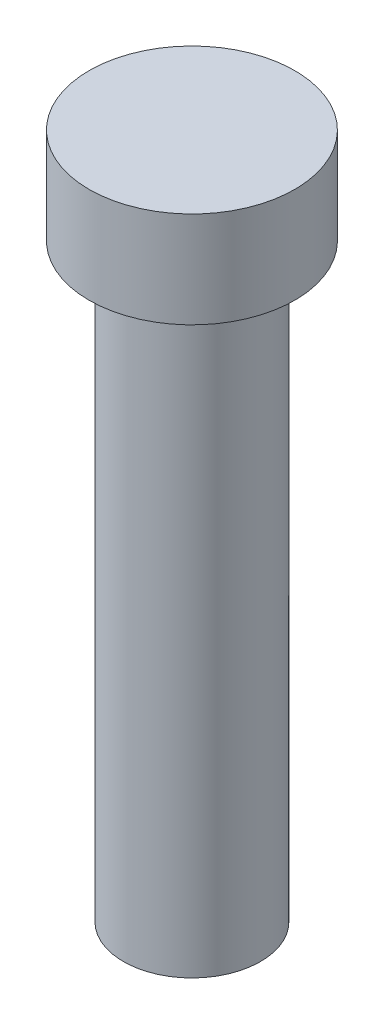
ISO-10303-21;
HEADER;
FILE_DESCRIPTION(('STEP AP214'),'2;1');
FILE_NAME('part.step','',(''),(''),'','','');
FILE_SCHEMA(('AUTOMOTIVE_DESIGN { 1 0 10303 214 1 1 1 1 }'));
ENDSEC;
DATA;
#1=APPLICATION_CONTEXT('core data for automotive mechanical design processes');
#2=APPLICATION_PROTOCOL_DEFINITION('international standard','automotive_design',2000,#1);
#3=PRODUCT_CONTEXT('',#1,'mechanical');
#4=PRODUCT('Part','Part','',(#3));
#5=PRODUCT_RELATED_PRODUCT_CATEGORY('part','',(#4));
#6=PRODUCT_DEFINITION_FORMATION('','',#4);
#7=PRODUCT_DEFINITION_CONTEXT('part definition',#1,'design');
#8=PRODUCT_DEFINITION('design','',#6,#7);
#9=PRODUCT_DEFINITION_SHAPE('','',#8);
#10=(LENGTH_UNIT() NAMED_UNIT(*) SI_UNIT(.MILLI.,.METRE.));
#11=(NAMED_UNIT(*) PLANE_ANGLE_UNIT() SI_UNIT($,.RADIAN.));
#12=(NAMED_UNIT(*) SI_UNIT($,.STERADIAN.) SOLID_ANGLE_UNIT());
#13=UNCERTAINTY_MEASURE_WITH_UNIT(LENGTH_MEASURE(1.E-05),#10,'distance_accuracy_value','');
#14=(GEOMETRIC_REPRESENTATION_CONTEXT(3) GLOBAL_UNCERTAINTY_ASSIGNED_CONTEXT((#13)) GLOBAL_UNIT_ASSIGNED_CONTEXT((#10,
#11,#12)) REPRESENTATION_CONTEXT('',''));
#15=CARTESIAN_POINT('',(0.,0.,0.));
#16=DIRECTION('',(0.,0.,1.));
#17=DIRECTION('',(1.,0.,0.));
#18=AXIS2_PLACEMENT_3D('',#15,#16,#17);
#19=CARTESIAN_POINT('',(0.,7.,0.));
#20=DIRECTION('',(0.,-1.,0.));
#21=DIRECTION('',(0.,0.,-1.));
#22=AXIS2_PLACEMENT_3D('',#19,#20,#21);
#23=CYLINDRICAL_SURFACE('',#22,7.5);
#24=CARTESIAN_POINT('',(0.,7.,0.));
#25=DIRECTION('',(0.,1.,0.));
#26=DIRECTION('',(0.,0.,1.));
#27=AXIS2_PLACEMENT_3D('',#24,#25,#26);
#28=CIRCLE('',#27,7.5);
#29=CARTESIAN_POINT('',(0.,7.,7.5));
#30=VERTEX_POINT('',#29);
#31=EDGE_CURVE('E45',#30,#30,#28,.T.);
#32=ORIENTED_EDGE('',*,*,#31,.F.);
#33=EDGE_LOOP('',(#32));
#34=FACE_BOUND('',#33,.T.);
#35=CARTESIAN_POINT('',(0.,0.,0.));
#36=DIRECTION('',(0.,1.,0.));
#37=DIRECTION('',(0.,0.,1.));
#38=AXIS2_PLACEMENT_3D('',#35,#36,#37);
#39=CIRCLE('',#38,7.5);
#40=CARTESIAN_POINT('',(0.,0.,7.5));
#41=VERTEX_POINT('',#40);
#42=EDGE_CURVE('E40',#41,#41,#39,.T.);
#43=ORIENTED_EDGE('',*,*,#42,.T.);
#44=EDGE_LOOP('',(#43));
#45=FACE_BOUND('',#44,.T.);
#46=ADVANCED_FACE('F37',(#34,#45),#23,.T.);
#47=CARTESIAN_POINT('',(0.,7.,0.));
#48=DIRECTION('',(0.,1.,0.));
#49=DIRECTION('',(0.,0.,1.));
#50=AXIS2_PLACEMENT_3D('',#47,#48,#49);
#51=PLANE('',#50);
#52=ORIENTED_EDGE('',*,*,#31,.T.);
#53=EDGE_LOOP('',(#52));
#54=FACE_BOUND('',#53,.T.);
#55=ADVANCED_FACE('F65',(#54),#51,.T.);
#56=CARTESIAN_POINT('',(0.,0.,0.));
#57=DIRECTION('',(0.,1.,0.));
#58=DIRECTION('',(0.,0.,1.));
#59=AXIS2_PLACEMENT_3D('',#56,#57,#58);
#60=PLANE('',#59);
#61=CARTESIAN_POINT('',(0.,0.,0.));
#62=DIRECTION('',(0.,-1.,0.));
#63=DIRECTION('',(0.,0.,-1.));
#64=AXIS2_PLACEMENT_3D('',#61,#62,#63);
#65=CIRCLE('',#64,5.);
#66=CARTESIAN_POINT('',(0.,0.,-5.));
#67=VERTEX_POINT('',#66);
#68=EDGE_CURVE('E10',#67,#67,#65,.T.);
#69=ORIENTED_EDGE('',*,*,#68,.F.);
#70=EDGE_LOOP('',(#69));
#71=FACE_BOUND('',#70,.T.);
#72=ORIENTED_EDGE('',*,*,#42,.F.);
#73=EDGE_LOOP('',(#72));
#74=FACE_BOUND('',#73,.T.);
#75=ADVANCED_FACE('F62',(#71,#74),#60,.F.);
#76=CARTESIAN_POINT('',(0.,-43.,0.));
#77=DIRECTION('',(0.,1.,0.));
#78=DIRECTION('',(0.,0.,1.));
#79=AXIS2_PLACEMENT_3D('',#76,#77,#78);
#80=CYLINDRICAL_SURFACE('',#79,5.);
#81=CARTESIAN_POINT('',(0.,-43.,0.));
#82=DIRECTION('',(0.,-1.,0.));
#83=DIRECTION('',(0.,0.,-1.));
#84=AXIS2_PLACEMENT_3D('',#81,#82,#83);
#85=CIRCLE('',#84,5.);
#86=CARTESIAN_POINT('',(0.,-43.,-5.));
#87=VERTEX_POINT('',#86);
#88=EDGE_CURVE('E52',#87,#87,#85,.T.);
#89=ORIENTED_EDGE('',*,*,#88,.F.);
#90=EDGE_LOOP('',(#89));
#91=FACE_BOUND('',#90,.T.);
#92=ORIENTED_EDGE('',*,*,#68,.T.);
#93=EDGE_LOOP('',(#92));
#94=FACE_BOUND('',#93,.T.);
#95=ADVANCED_FACE('F64',(#91,#94),#80,.T.);
#96=CARTESIAN_POINT('',(0.,-43.,0.));
#97=DIRECTION('',(0.,-1.,0.));
#98=DIRECTION('',(0.,0.,-1.));
#99=AXIS2_PLACEMENT_3D('',#96,#97,#98);
#100=PLANE('',#99);
#101=ORIENTED_EDGE('',*,*,#88,.T.);
#102=EDGE_LOOP('',(#101));
#103=FACE_BOUND('',#102,.T.);
#104=ADVANCED_FACE('F71',(#103),#100,.T.);
#105=CLOSED_SHELL('',(#46,#55,#75,#95,#104));
#106=MANIFOLD_SOLID_BREP('B2',#105);
#107=ADVANCED_BREP_SHAPE_REPRESENTATION('',(#18,#106),#14);
#108=SHAPE_DEFINITION_REPRESENTATION(#9,#107);
ENDSEC;
END-ISO-10303-21;
